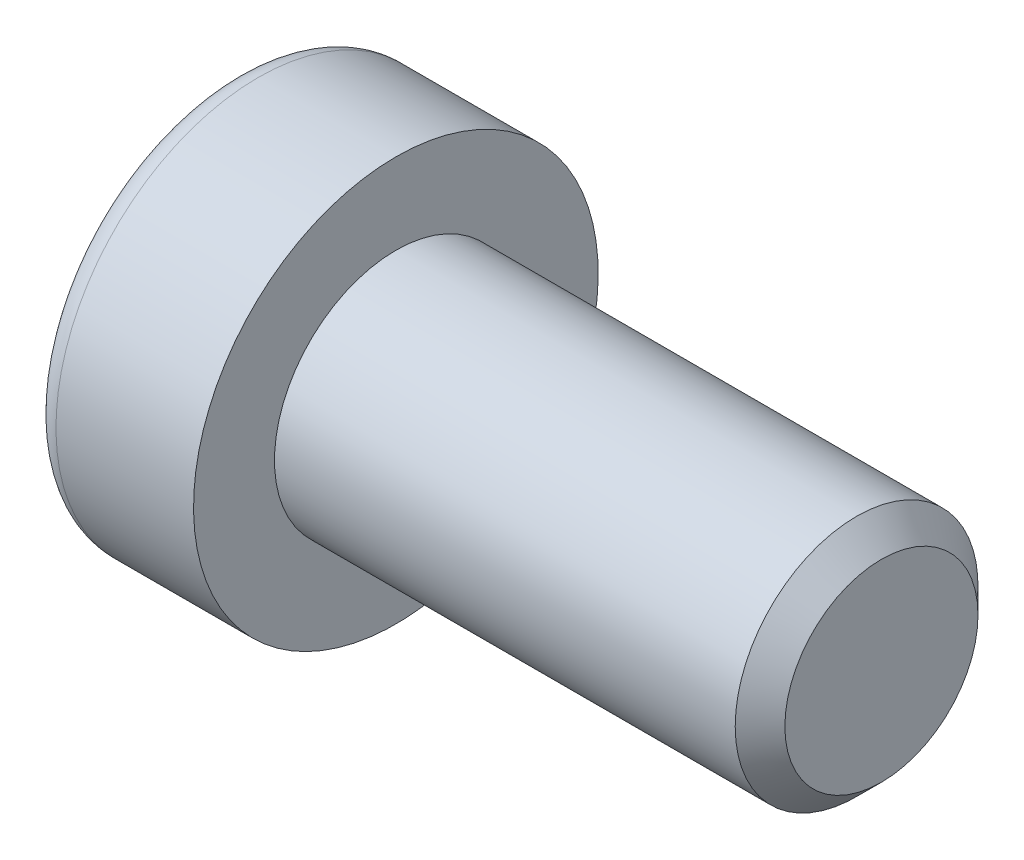
ISO-10303-21;
HEADER;
FILE_DESCRIPTION(('STEP AP214'),'2;1');
FILE_NAME('part.step','',(''),(''),'','','');
FILE_SCHEMA(('AUTOMOTIVE_DESIGN { 1 0 10303 214 1 1 1 1 }'));
ENDSEC;
DATA;
#1=APPLICATION_CONTEXT('core data for automotive mechanical design processes');
#2=APPLICATION_PROTOCOL_DEFINITION('international standard','automotive_design',2000,#1);
#3=PRODUCT_CONTEXT('',#1,'mechanical');
#4=PRODUCT('Part','Part','',(#3));
#5=PRODUCT_RELATED_PRODUCT_CATEGORY('part','',(#4));
#6=PRODUCT_DEFINITION_FORMATION('','',#4);
#7=PRODUCT_DEFINITION_CONTEXT('part definition',#1,'design');
#8=PRODUCT_DEFINITION('design','',#6,#7);
#9=PRODUCT_DEFINITION_SHAPE('','',#8);
#10=(LENGTH_UNIT() NAMED_UNIT(*) SI_UNIT(.MILLI.,.METRE.));
#11=(NAMED_UNIT(*) PLANE_ANGLE_UNIT() SI_UNIT($,.RADIAN.));
#12=(NAMED_UNIT(*) SI_UNIT($,.STERADIAN.) SOLID_ANGLE_UNIT());
#13=UNCERTAINTY_MEASURE_WITH_UNIT(LENGTH_MEASURE(1.E-05),#10,'distance_accuracy_value','');
#14=(GEOMETRIC_REPRESENTATION_CONTEXT(3) GLOBAL_UNCERTAINTY_ASSIGNED_CONTEXT((#13)) GLOBAL_UNIT_ASSIGNED_CONTEXT((#10,
#11,#12)) REPRESENTATION_CONTEXT('',''));
#15=CARTESIAN_POINT('',(0.,0.,0.));
#16=DIRECTION('',(0.,0.,1.));
#17=DIRECTION('',(1.,0.,0.));
#18=AXIS2_PLACEMENT_3D('',#15,#16,#17);
#19=CARTESIAN_POINT('',(-1.00800000126355,0.,0.));
#20=DIRECTION('',(-1.,0.,0.));
#21=DIRECTION('',(0.,0.,1.));
#22=AXIS2_PLACEMENT_3D('',#19,#20,#21);
#23=CONICAL_SURFACE('',#22,2.32325748220319,1.04719754984266);
#24=CARTESIAN_POINT('',(0.333333335333919,-2.27373675443232E-10,0.));
#25=VERTEX_POINT('',#24);
#26=VERTEX_LOOP('',#25);
#27=FACE_BOUND('',#26,.T.);
#28=CARTESIAN_POINT('',(-1.00000000148083,2.00000000033728,1.15470053795177));
#29=CARTESIAN_POINT('',(-0.970695546656412,2.00000000012114,1.05321634683082));
#30=CARTESIAN_POINT('',(-0.944044678609069,2.00000000003247,0.950856145630906));
#31=CARTESIAN_POINT('',(-0.897526388820767,1.99999999996746,0.744363444823034));
#32=CARTESIAN_POINT('',(-0.877675421691299,1.99999999999139,0.640227277433704));
#33=CARTESIAN_POINT('',(-0.84677596021723,2.0000000000084,0.43324544997504));
#34=CARTESIAN_POINT('',(-0.835521788851128,2.00000000000224,0.330431627792259));
#35=CARTESIAN_POINT('',(-0.822089169378264,1.99999999999776,0.124320462818437));
#36=CARTESIAN_POINT('',(-0.819899595232345,1.99999999999944,0.0210238686714094));
#37=CARTESIAN_POINT('',(-0.824466291460138,2.00000000000049,-0.171974736001679));
#38=CARTESIAN_POINT('',(-0.830101286547052,2.00000000000013,-0.261705707541263));
#39=CARTESIAN_POINT('',(-0.847957302106096,1.99999999999987,-0.440583082607356));
#40=CARTESIAN_POINT('',(-0.86018441618838,1.99999999999996,-0.529728867906561));
#41=CARTESIAN_POINT('',(-0.890749834828529,2.00000000000004,-0.708974747233866));
#42=CARTESIAN_POINT('',(-0.909217643747823,2.00000000000002,-0.799052166721046));
#43=CARTESIAN_POINT('',(-0.95113176245156,1.99999999999998,-0.977863889550314));
#44=CARTESIAN_POINT('',(-0.974568230407688,1.99999999999996,-1.06660048191016));
#45=CARTESIAN_POINT('',(-1.00000000170015,2.,-1.15470053794658));
#46=B_SPLINE_CURVE_WITH_KNOTS('',3,(#28,#29,#30,#31,#32,#33,#34,#35,#36,#37,#38,#39,#40,#41,#42,
#43,#44,#45),.UNSPECIFIED.,.F.,.F.,(4,2,2,2,2,2,2,2,4),(0.,0.317016011629405,0.634793817184081,
0.944707606355673,1.25424088914081,1.52370778262096,1.79342419353215,2.06912162199251,
2.34427797278029),.UNSPECIFIED.);
#47=CARTESIAN_POINT('',(-1.00000000168466,1.99999999978942,1.15470053825767));
#48=VERTEX_POINT('',#47);
#49=CARTESIAN_POINT('',(-1.00000000175486,2.,-1.15470053813609));
#50=VERTEX_POINT('',#49);
#51=EDGE_CURVE('E18',#48,#50,#46,.T.);
#52=ORIENTED_EDGE('',*,*,#51,.T.);
#53=CARTESIAN_POINT('',(-1.00000000148083,1.99999999979843,-1.15470053888509));
#54=CARTESIAN_POINT('',(-0.970695546656412,1.91211211209711,-1.20544263425837));
#55=CARTESIAN_POINT('',(-0.94404467860907,1.82346557747715,-1.25662273478154));
#56=CARTESIAN_POINT('',(-0.897526388820768,1.64463765284897,-1.35986908512918));
#57=CARTESIAN_POINT('',(-0.877675421691298,1.55445308644903,-1.41193716884456));
#58=CARTESIAN_POINT('',(-0.84677596021723,1.37520156575661,-1.51542808258863));
#59=CARTESIAN_POINT('',(-0.835521788851128,1.28616218388306,-1.56683499367469));
#60=CARTESIAN_POINT('',(-0.822089169378264,1.10766467900989,-1.66989057615772));
#61=CARTESIAN_POINT('',(-0.819899595232345,1.01820720435499,-1.72153887323269));
#62=CARTESIAN_POINT('',(-0.824466291460138,0.851065509813669,-1.81803817557014));
#63=CARTESIAN_POINT('',(-0.830101286547052,0.773356208953953,-1.86290366133962));
#64=CARTESIAN_POINT('',(-0.847957302106096,0.618443857984307,-1.95234234887244));
#65=CARTESIAN_POINT('',(-0.860184416188379,0.541241343274929,-1.99691524152212));
#66=CARTESIAN_POINT('',(-0.890749834828528,0.386009858253841,-2.08653818118584));
#67=CARTESIAN_POINT('',(-0.909217643747822,0.308000524670587,-2.13157689092942));
#68=CARTESIAN_POINT('',(-0.95113176245156,0.153145030205959,-2.22098275234402));
#69=CARTESIAN_POINT('',(-0.974568230407687,0.076296886977059,-2.26535104852392));
#70=CARTESIAN_POINT('',(-1.00000000170015,3.74709208758417E-10,-2.30940107654216));
#71=B_SPLINE_CURVE_WITH_KNOTS('',3,(#53,#54,#55,#56,#57,#58,#59,#60,#61,#62,#63,#64,#65,#66,#67,
#68,#69,#70),.UNSPECIFIED.,.F.,.F.,(4,2,2,2,2,2,2,2,4),(0.,0.317016011629406,0.634793817184081,
0.944707606355673,1.25424088914081,1.52370778262096,1.79342419353215,2.06912162199251,
2.34427797278028),.UNSPECIFIED.);
#72=CARTESIAN_POINT('',(-1.00000000168466,0.,-2.30940107651534));
#73=VERTEX_POINT('',#72);
#74=EDGE_CURVE('E78',#50,#73,#71,.T.);
#75=ORIENTED_EDGE('',*,*,#74,.T.);
#76=CARTESIAN_POINT('',(-1.00000000148083,-5.3885051347837E-10,-2.30940107683686));
#77=CARTESIAN_POINT('',(-0.970695546656412,-0.0878878880240306,-2.2586589810892));
#78=CARTESIAN_POINT('',(-0.944044678609069,-0.176534422555312,-2.20747888041245));
#79=CARTESIAN_POINT('',(-0.897526388820767,-0.355362347118482,-2.10423252995221));
#80=CARTESIAN_POINT('',(-0.877675421691299,-0.445546913542355,-2.05216444627827));
#81=CARTESIAN_POINT('',(-0.84677596021723,-0.624798434251795,-1.94867353256368));
#82=CARTESIAN_POINT('',(-0.835521788851128,-0.713837816119177,-1.89726662146695));
#83=CARTESIAN_POINT('',(-0.822089169378264,-0.892335320987875,-1.79421103897616));
#84=CARTESIAN_POINT('',(-0.819899595232345,-0.981792795644449,-1.7425627419041));
#85=CARTESIAN_POINT('',(-0.824466291460138,-1.14893449018682,-1.64606343956846));
#86=CARTESIAN_POINT('',(-0.830101286547052,-1.22664379104618,-1.60119795379836));
#87=CARTESIAN_POINT('',(-0.847957302106096,-1.38155614201556,-1.51175926626509));
#88=CARTESIAN_POINT('',(-0.860184416188379,-1.45875865672503,-1.46718637361557));
#89=CARTESIAN_POINT('',(-0.890749834828529,-1.6139901417462,-1.37756343395198));
#90=CARTESIAN_POINT('',(-0.909217643747823,-1.69199947532943,-1.33252472420837));
#91=CARTESIAN_POINT('',(-0.95113176245156,-1.84685496979402,-1.2431188627937));
#92=CARTESIAN_POINT('',(-0.974568230407687,-1.9237031130229,-1.19875056661377));
#93=CARTESIAN_POINT('',(-1.00000000170015,-1.99999999962529,-1.15470053859559));
#94=B_SPLINE_CURVE_WITH_KNOTS('',3,(#76,#77,#78,#79,#80,#81,#82,#83,#84,#85,#86,#87,#88,#89,#90,
#91,#92,#93),.UNSPECIFIED.,.F.,.F.,(4,2,2,2,2,2,2,2,4),(0.,0.317016011629405,0.63479381718408,
0.944707606355672,1.25424088914081,1.52370778262096,1.79342419353215,2.06912162199251,
2.34427797278029),.UNSPECIFIED.);
#95=CARTESIAN_POINT('',(-1.00000000168466,-1.99999999978942,-1.15470053825767));
#96=VERTEX_POINT('',#95);
#97=EDGE_CURVE('E103',#73,#96,#94,.T.);
#98=ORIENTED_EDGE('',*,*,#97,.T.);
#99=CARTESIAN_POINT('',(-1.00000000148083,-2.00000000033728,-1.15470053795177));
#100=CARTESIAN_POINT('',(-0.970695546656412,-2.00000000012114,-1.05321634683083));
#101=CARTESIAN_POINT('',(-0.944044678609069,-2.00000000003247,-0.950856145630907));
#102=CARTESIAN_POINT('',(-0.897526388820767,-1.99999999996746,-0.744363444823036));
#103=CARTESIAN_POINT('',(-0.877675421691298,-1.99999999999138,-0.640227277433706));
#104=CARTESIAN_POINT('',(-0.84677596021723,-2.0000000000084,-0.433245449975042));
#105=CARTESIAN_POINT('',(-0.835521788851128,-2.00000000000224,-0.330431627792262));
#106=CARTESIAN_POINT('',(-0.822089169378263,-1.99999999999776,-0.124320462818439));
#107=CARTESIAN_POINT('',(-0.819899595232344,-1.99999999999944,-0.0210238686714119));
#108=CARTESIAN_POINT('',(-0.824466291460138,-2.00000000000049,0.171974736001677));
#109=CARTESIAN_POINT('',(-0.830101286547052,-2.00000000000013,0.26170570754126));
#110=CARTESIAN_POINT('',(-0.847957302106096,-1.99999999999987,0.440583082607354));
#111=CARTESIAN_POINT('',(-0.860184416188379,-1.99999999999996,0.529728867906559));
#112=CARTESIAN_POINT('',(-0.890749834828528,-2.00000000000004,0.708974747233865));
#113=CARTESIAN_POINT('',(-0.909217643747822,-2.00000000000002,0.799052166721045));
#114=CARTESIAN_POINT('',(-0.951131762451559,-1.99999999999998,0.977863889550313));
#115=CARTESIAN_POINT('',(-0.974568230407687,-1.99999999999996,1.06660048191016));
#116=CARTESIAN_POINT('',(-1.00000000170015,-2.,1.15470053794658));
#117=B_SPLINE_CURVE_WITH_KNOTS('',3,(#99,#100,#101,#102,#103,#104,#105,#106,#107,#108,#109,#110,
#111,#112,#113,#114,#115,#116),.UNSPECIFIED.,.F.,.F.,(4,2,2,2,2,2,2,2,4),(0.,0.317016011629405,
0.63479381718408,0.944707606355672,1.25424088914081,1.52370778262096,1.79342419353215,
2.06912162199251,2.34427797278029),.UNSPECIFIED.);
#118=CARTESIAN_POINT('',(-1.00000000168466,-1.99999999978942,1.15470053825767));
#119=VERTEX_POINT('',#118);
#120=EDGE_CURVE('E127',#96,#119,#117,.T.);
#121=ORIENTED_EDGE('',*,*,#120,.T.);
#122=CARTESIAN_POINT('',(-1.00000000148083,-1.99999999979843,1.15470053888509));
#123=CARTESIAN_POINT('',(-0.970695546656412,-1.91211211209711,1.20544263425837));
#124=CARTESIAN_POINT('',(-0.94404467860907,-1.82346557747716,1.25662273478154));
#125=CARTESIAN_POINT('',(-0.897526388820768,-1.64463765284897,1.35986908512917));
#126=CARTESIAN_POINT('',(-0.877675421691299,-1.55445308644903,1.41193716884456));
#127=CARTESIAN_POINT('',(-0.84677596021723,-1.37520156575661,1.51542808258863));
#128=CARTESIAN_POINT('',(-0.835521788851128,-1.28616218388306,1.56683499367469));
#129=CARTESIAN_POINT('',(-0.822089169378263,-1.10766467900989,1.66989057615772));
#130=CARTESIAN_POINT('',(-0.819899595232344,-1.01820720435499,1.72153887323269));
#131=CARTESIAN_POINT('',(-0.824466291460138,-0.85106550981367,1.81803817557014));
#132=CARTESIAN_POINT('',(-0.830101286547052,-0.773356208953954,1.86290366133962));
#133=CARTESIAN_POINT('',(-0.847957302106096,-0.618443857984308,1.95234234887244));
#134=CARTESIAN_POINT('',(-0.860184416188379,-0.54124134327493,1.99691524152212));
#135=CARTESIAN_POINT('',(-0.890749834828528,-0.386009858253842,2.08653818118584));
#136=CARTESIAN_POINT('',(-0.909217643747822,-0.308000524670587,2.13157689092942));
#137=CARTESIAN_POINT('',(-0.951131762451559,-0.153145030205959,2.22098275234402));
#138=CARTESIAN_POINT('',(-0.974568230407687,-0.076296886977059,2.26535104852392));
#139=CARTESIAN_POINT('',(-1.00000000170015,-3.74708969238079E-10,2.30940107654216));
#140=B_SPLINE_CURVE_WITH_KNOTS('',3,(#122,#123,#124,#125,#126,#127,#128,#129,#130,#131,#132,
#133,#134,#135,#136,#137,#138,#139),.UNSPECIFIED.,.F.,.F.,(4,2,2,2,2,2,2,2,4),(0.,
0.317016011629405,0.63479381718408,0.944707606355673,1.25424088914081,1.52370778262096,
1.79342419353215,2.06912162199251,2.34427797278029),.UNSPECIFIED.);
#141=CARTESIAN_POINT('',(-1.00000000168466,0.,2.30940107651534));
#142=VERTEX_POINT('',#141);
#143=EDGE_CURVE('E135',#119,#142,#140,.T.);
#144=ORIENTED_EDGE('',*,*,#143,.T.);
#145=CARTESIAN_POINT('',(-1.00000000148083,5.38850492788213E-10,2.30940107683686));
#146=CARTESIAN_POINT('',(-0.970695546656412,0.0878878880240308,2.2586589810892));
#147=CARTESIAN_POINT('',(-0.944044678609069,0.176534422555312,2.20747888041245));
#148=CARTESIAN_POINT('',(-0.897526388820767,0.355362347118482,2.10423252995221));
#149=CARTESIAN_POINT('',(-0.877675421691298,0.445546913542355,2.05216444627827));
#150=CARTESIAN_POINT('',(-0.846775960217229,0.624798434251794,1.94867353256367));
#151=CARTESIAN_POINT('',(-0.835521788851128,0.713837816119177,1.89726662146695));
#152=CARTESIAN_POINT('',(-0.822089169378263,0.892335320987874,1.79421103897616));
#153=CARTESIAN_POINT('',(-0.819899595232344,0.981792795644449,1.7425627419041));
#154=CARTESIAN_POINT('',(-0.824466291460137,1.14893449018682,1.64606343956846));
#155=CARTESIAN_POINT('',(-0.830101286547051,1.22664379104618,1.60119795379836));
#156=CARTESIAN_POINT('',(-0.847957302106095,1.38155614201556,1.51175926626508));
#157=CARTESIAN_POINT('',(-0.860184416188378,1.45875865672503,1.46718637361556));
#158=CARTESIAN_POINT('',(-0.890749834828528,1.6139901417462,1.37756343395198));
#159=CARTESIAN_POINT('',(-0.909217643747822,1.69199947532943,1.33252472420837));
#160=CARTESIAN_POINT('',(-0.951131762451559,1.84685496979402,1.2431188627937));
#161=CARTESIAN_POINT('',(-0.974568230407686,1.9237031130229,1.19875056661376));
#162=CARTESIAN_POINT('',(-1.00000000170015,1.99999999962529,1.15470053859559));
#163=B_SPLINE_CURVE_WITH_KNOTS('',3,(#145,#146,#147,#148,#149,#150,#151,#152,#153,#154,#155,
#156,#157,#158,#159,#160,#161,#162),.UNSPECIFIED.,.F.,.F.,(4,2,2,2,2,2,2,2,4),(0.,
0.317016011629406,0.63479381718408,0.944707606355673,1.25424088914081,1.52370778262096,
1.79342419353215,2.06912162199251,2.34427797278029),.UNSPECIFIED.);
#164=EDGE_CURVE('E80',#142,#48,#163,.T.);
#165=ORIENTED_EDGE('',*,*,#164,.T.);
#166=EDGE_LOOP('',(#52,#75,#98,#121,#144,#165));
#167=FACE_BOUND('',#166,.T.);
#168=ADVANCED_FACE('F14',(#27,#167),#23,.F.);
#169=CARTESIAN_POINT('',(-3.99999999999999,2.,1.15470053837925));
#170=DIRECTION('',(0.,1.,0.));
#171=DIRECTION('',(0.,0.,1.));
#172=AXIS2_PLACEMENT_3D('',#169,#170,#171);
#173=PLANE('',#172);
#174=DIRECTION('',(1.,0.,0.));
#175=VECTOR('',#174,1.);
#176=CARTESIAN_POINT('',(-3.99999999999999,2.,1.15470053837925));
#177=LINE('',#176,#175);
#178=CARTESIAN_POINT('',(-3.99999999999999,2.,1.15470053837925));
#179=VERTEX_POINT('',#178);
#180=EDGE_CURVE('E82',#48,#179,#177,.F.);
#181=ORIENTED_EDGE('',*,*,#180,.T.);
#182=DIRECTION('',(0.,0.,1.));
#183=VECTOR('',#182,1.);
#184=CARTESIAN_POINT('',(-3.99999999999999,2.,0.));
#185=LINE('',#184,#183);
#186=CARTESIAN_POINT('',(-3.99999999999999,2.,-1.15470053837925));
#187=VERTEX_POINT('',#186);
#188=EDGE_CURVE('E87',#187,#179,#185,.T.);
#189=ORIENTED_EDGE('',*,*,#188,.F.);
#190=DIRECTION('',(1.,0.,0.));
#191=VECTOR('',#190,1.);
#192=CARTESIAN_POINT('',(-3.99999999999999,2.,-1.15470053837925));
#193=LINE('',#192,#191);
#194=EDGE_CURVE('E85',#187,#50,#193,.T.);
#195=ORIENTED_EDGE('',*,*,#194,.T.);
#196=ORIENTED_EDGE('',*,*,#51,.F.);
#197=EDGE_LOOP('',(#181,#189,#195,#196));
#198=FACE_BOUND('',#197,.T.);
#199=ADVANCED_FACE('F74',(#198),#173,.F.);
#200=CARTESIAN_POINT('',(-3.99999999999999,0.,2.3094010767585));
#201=DIRECTION('',(0.,0.500000000000001,0.866025403784438));
#202=DIRECTION('',(0.,-0.866025403784438,0.500000000000001));
#203=AXIS2_PLACEMENT_3D('',#200,#201,#202);
#204=PLANE('',#203);
#205=DIRECTION('',(1.,0.,0.));
#206=VECTOR('',#205,1.);
#207=CARTESIAN_POINT('',(-3.99999999999999,0.,2.3094010767585));
#208=LINE('',#207,#206);
#209=CARTESIAN_POINT('',(-3.99999999999999,0.,2.3094010767585));
#210=VERTEX_POINT('',#209);
#211=EDGE_CURVE('E139',#142,#210,#208,.F.);
#212=ORIENTED_EDGE('',*,*,#211,.T.);
#213=DIRECTION('',(0.,-0.866025403784438,0.500000000000001));
#214=VECTOR('',#213,1.);
#215=CARTESIAN_POINT('',(-3.99999999999999,2.,1.15470053837925));
#216=LINE('',#215,#214);
#217=EDGE_CURVE('E93',#179,#210,#216,.T.);
#218=ORIENTED_EDGE('',*,*,#217,.F.);
#219=ORIENTED_EDGE('',*,*,#180,.F.);
#220=ORIENTED_EDGE('',*,*,#164,.F.);
#221=EDGE_LOOP('',(#212,#218,#219,#220));
#222=FACE_BOUND('',#221,.T.);
#223=ADVANCED_FACE('F143',(#222),#204,.F.);
#224=CARTESIAN_POINT('',(-3.99999999999999,-2.,1.15470053837925));
#225=DIRECTION('',(0.,-0.5,0.866025403784439));
#226=DIRECTION('',(0.,-0.866025403784439,-0.5));
#227=AXIS2_PLACEMENT_3D('',#224,#225,#226);
#228=PLANE('',#227);
#229=DIRECTION('',(1.,0.,0.));
#230=VECTOR('',#229,1.);
#231=CARTESIAN_POINT('',(-3.99999999999999,-2.,1.15470053837925));
#232=LINE('',#231,#230);
#233=CARTESIAN_POINT('',(-3.99999999999999,-2.,1.15470053837925));
#234=VERTEX_POINT('',#233);
#235=EDGE_CURVE('E134',#119,#234,#232,.F.);
#236=ORIENTED_EDGE('',*,*,#235,.T.);
#237=DIRECTION('',(0.,-0.866025403784439,-0.5));
#238=VECTOR('',#237,1.);
#239=CARTESIAN_POINT('',(-3.99999999999999,0.,2.3094010767585));
#240=LINE('',#239,#238);
#241=EDGE_CURVE('E240',#210,#234,#240,.T.);
#242=ORIENTED_EDGE('',*,*,#241,.F.);
#243=ORIENTED_EDGE('',*,*,#211,.F.);
#244=ORIENTED_EDGE('',*,*,#143,.F.);
#245=EDGE_LOOP('',(#236,#242,#243,#244));
#246=FACE_BOUND('',#245,.T.);
#247=ADVANCED_FACE('F123',(#246),#228,.F.);
#248=CARTESIAN_POINT('',(-3.99999999999999,-2.,-1.15470053837925));
#249=DIRECTION('',(0.,-1.,0.));
#250=DIRECTION('',(0.,0.,-1.));
#251=AXIS2_PLACEMENT_3D('',#248,#249,#250);
#252=PLANE('',#251);
#253=DIRECTION('',(1.,0.,0.));
#254=VECTOR('',#253,1.);
#255=CARTESIAN_POINT('',(-3.99999999999999,-2.,-1.15470053837925));
#256=LINE('',#255,#254);
#257=CARTESIAN_POINT('',(-3.99999999999999,-2.,-1.15470053837925));
#258=VERTEX_POINT('',#257);
#259=EDGE_CURVE('E133',#96,#258,#256,.F.);
#260=ORIENTED_EDGE('',*,*,#259,.T.);
#261=DIRECTION('',(0.,0.,1.));
#262=VECTOR('',#261,1.);
#263=CARTESIAN_POINT('',(-3.99999999999999,-2.,0.));
#264=LINE('',#263,#262);
#265=EDGE_CURVE('E235',#234,#258,#264,.F.);
#266=ORIENTED_EDGE('',*,*,#265,.F.);
#267=ORIENTED_EDGE('',*,*,#235,.F.);
#268=ORIENTED_EDGE('',*,*,#120,.F.);
#269=EDGE_LOOP('',(#260,#266,#267,#268));
#270=FACE_BOUND('',#269,.T.);
#271=ADVANCED_FACE('F119',(#270),#252,.F.);
#272=CARTESIAN_POINT('',(-3.99999999999999,0.,-2.3094010767585));
#273=DIRECTION('',(0.,-0.5,-0.866025403784439));
#274=DIRECTION('',(0.,0.866025403784439,-0.5));
#275=AXIS2_PLACEMENT_3D('',#272,#273,#274);
#276=PLANE('',#275);
#277=DIRECTION('',(1.,0.,0.));
#278=VECTOR('',#277,1.);
#279=CARTESIAN_POINT('',(-3.99999999999999,0.,-2.3094010767585));
#280=LINE('',#279,#278);
#281=CARTESIAN_POINT('',(-3.99999999999999,0.,-2.3094010767585));
#282=VERTEX_POINT('',#281);
#283=EDGE_CURVE('E36',#73,#282,#280,.F.);
#284=ORIENTED_EDGE('',*,*,#283,.T.);
#285=DIRECTION('',(0.,0.866025403784438,-0.5));
#286=VECTOR('',#285,1.);
#287=CARTESIAN_POINT('',(-3.99999999999999,-2.,-1.15470053837925));
#288=LINE('',#287,#286);
#289=EDGE_CURVE('E230',#258,#282,#288,.T.);
#290=ORIENTED_EDGE('',*,*,#289,.F.);
#291=ORIENTED_EDGE('',*,*,#259,.F.);
#292=ORIENTED_EDGE('',*,*,#97,.F.);
#293=EDGE_LOOP('',(#284,#290,#291,#292));
#294=FACE_BOUND('',#293,.T.);
#295=ADVANCED_FACE('F113',(#294),#276,.F.);
#296=CARTESIAN_POINT('',(-3.99999999999999,2.,-1.15470053837925));
#297=DIRECTION('',(0.,0.5,-0.866025403784439));
#298=DIRECTION('',(0.,0.866025403784439,0.5));
#299=AXIS2_PLACEMENT_3D('',#296,#297,#298);
#300=PLANE('',#299);
#301=ORIENTED_EDGE('',*,*,#194,.F.);
#302=DIRECTION('',(0.,0.866025403784439,0.5));
#303=VECTOR('',#302,1.);
#304=CARTESIAN_POINT('',(-3.99999999999999,0.,-2.3094010767585));
#305=LINE('',#304,#303);
#306=EDGE_CURVE('E228',#282,#187,#305,.T.);
#307=ORIENTED_EDGE('',*,*,#306,.F.);
#308=ORIENTED_EDGE('',*,*,#283,.F.);
#309=ORIENTED_EDGE('',*,*,#74,.F.);
#310=EDGE_LOOP('',(#301,#307,#308,#309));
#311=FACE_BOUND('',#310,.T.);
#312=ADVANCED_FACE('F91',(#311),#300,.F.);
#313=CARTESIAN_POINT('',(-3.99999999999999,3.65470053837925,0.));
#314=DIRECTION('',(-1.,0.,0.));
#315=DIRECTION('',(0.,0.,1.));
#316=AXIS2_PLACEMENT_3D('',#313,#314,#315);
#317=PLANE('',#316);
#318=ORIENTED_EDGE('',*,*,#289,.T.);
#319=ORIENTED_EDGE('',*,*,#306,.T.);
#320=ORIENTED_EDGE('',*,*,#188,.T.);
#321=ORIENTED_EDGE('',*,*,#217,.T.);
#322=ORIENTED_EDGE('',*,*,#241,.T.);
#323=ORIENTED_EDGE('',*,*,#265,.T.);
#324=EDGE_LOOP('',(#318,#319,#320,#321,#322,#323));
#325=FACE_BOUND('',#324,.T.);
#326=CARTESIAN_POINT('',(-3.99999999999999,0.,0.));
#327=DIRECTION('',(1.,0.,0.));
#328=DIRECTION('',(0.,1.,0.));
#329=AXIS2_PLACEMENT_3D('',#326,#327,#328);
#330=CIRCLE('',#329,4.4);
#331=CARTESIAN_POINT('',(-3.99999999999999,4.4,0.));
#332=VERTEX_POINT('',#331);
#333=EDGE_CURVE('E191',#332,#332,#330,.T.);
#334=ORIENTED_EDGE('',*,*,#333,.F.);
#335=EDGE_LOOP('',(#334));
#336=FACE_BOUND('',#335,.T.);
#337=ADVANCED_FACE('F112',(#325,#336),#317,.T.);
#338=CARTESIAN_POINT('',(-3.4,0.,0.));
#339=DIRECTION('',(1.,0.,0.));
#340=DIRECTION('',(0.,0.,-1.));
#341=AXIS2_PLACEMENT_3D('',#338,#339,#340);
#342=TOROIDAL_SURFACE('',#341,4.4,0.6);
#343=CARTESIAN_POINT('',(-3.4,0.,0.));
#344=DIRECTION('',(1.,0.,0.));
#345=DIRECTION('',(0.,1.,0.));
#346=AXIS2_PLACEMENT_3D('',#343,#344,#345);
#347=CIRCLE('',#346,5.);
#348=CARTESIAN_POINT('',(-3.4,5.,0.));
#349=VERTEX_POINT('',#348);
#350=EDGE_CURVE('E256',#349,#349,#347,.T.);
#351=ORIENTED_EDGE('',*,*,#350,.F.);
#352=EDGE_LOOP('',(#351));
#353=FACE_BOUND('',#352,.T.);
#354=ORIENTED_EDGE('',*,*,#333,.T.);
#355=EDGE_LOOP('',(#354));
#356=FACE_BOUND('',#355,.T.);
#357=ADVANCED_FACE('F175',(#353,#356),#342,.T.);
#358=CARTESIAN_POINT('',(-2.,0.,0.));
#359=DIRECTION('',(1.,0.,0.));
#360=DIRECTION('',(0.,1.,0.));
#361=AXIS2_PLACEMENT_3D('',#358,#359,#360);
#362=CYLINDRICAL_SURFACE('',#361,5.);
#363=ORIENTED_EDGE('',*,*,#350,.T.);
#364=EDGE_LOOP('',(#363));
#365=FACE_BOUND('',#364,.T.);
#366=CARTESIAN_POINT('',(0.,0.,0.));
#367=DIRECTION('',(1.,0.,0.));
#368=DIRECTION('',(0.,1.,0.));
#369=AXIS2_PLACEMENT_3D('',#366,#367,#368);
#370=CIRCLE('',#369,5.);
#371=CARTESIAN_POINT('',(0.,5.,0.));
#372=VERTEX_POINT('',#371);
#373=EDGE_CURVE('E101',#372,#372,#370,.T.);
#374=ORIENTED_EDGE('',*,*,#373,.F.);
#375=EDGE_LOOP('',(#374));
#376=FACE_BOUND('',#375,.T.);
#377=ADVANCED_FACE('F172',(#365,#376),#362,.T.);
#378=CARTESIAN_POINT('',(12.,1.5,0.));
#379=DIRECTION('',(1.,0.,0.));
#380=DIRECTION('',(0.,0.,-1.));
#381=AXIS2_PLACEMENT_3D('',#378,#379,#380);
#382=PLANE('',#381);
#383=CARTESIAN_POINT('',(12.0000000002847,0.,0.));
#384=DIRECTION('',(-1.,0.,0.));
#385=DIRECTION('',(0.,0.,1.));
#386=AXIS2_PLACEMENT_3D('',#383,#384,#385);
#387=CIRCLE('',#386,2.38655000026711);
#388=CARTESIAN_POINT('',(12.0000000002847,0.,2.38655000026711));
#389=VERTEX_POINT('',#388);
#390=EDGE_CURVE('E252',#389,#389,#387,.T.);
#391=ORIENTED_EDGE('',*,*,#390,.F.);
#392=EDGE_LOOP('',(#391));
#393=FACE_BOUND('',#392,.T.);
#394=ADVANCED_FACE('F168',(#393),#382,.T.);
#395=CARTESIAN_POINT('',(0.,4.,0.));
#396=DIRECTION('',(1.,0.,0.));
#397=DIRECTION('',(0.,0.,-1.));
#398=AXIS2_PLACEMENT_3D('',#395,#396,#397);
#399=PLANE('',#398);
#400=CARTESIAN_POINT('',(0.,0.,0.));
#401=DIRECTION('',(1.,0.,0.));
#402=DIRECTION('',(0.,1.,0.));
#403=AXIS2_PLACEMENT_3D('',#400,#401,#402);
#404=CIRCLE('',#403,3.);
#405=CARTESIAN_POINT('',(0.,3.,0.));
#406=VERTEX_POINT('',#405);
#407=EDGE_CURVE('E27',#406,#406,#404,.T.);
#408=ORIENTED_EDGE('',*,*,#407,.F.);
#409=EDGE_LOOP('',(#408));
#410=FACE_BOUND('',#409,.T.);
#411=ORIENTED_EDGE('',*,*,#373,.T.);
#412=EDGE_LOOP('',(#411));
#413=FACE_BOUND('',#412,.T.);
#414=ADVANCED_FACE('F161',(#410,#413),#399,.T.);
#415=CARTESIAN_POINT('',(11.3865499997132,0.,0.));
#416=DIRECTION('',(-1.,0.,0.));
#417=DIRECTION('',(0.,0.,1.));
#418=AXIS2_PLACEMENT_3D('',#415,#416,#417);
#419=CONICAL_SURFACE('',#418,2.99999999975853,0.785398162517161);
#420=ORIENTED_EDGE('',*,*,#390,.T.);
#421=EDGE_LOOP('',(#420));
#422=FACE_BOUND('',#421,.T.);
#423=CARTESIAN_POINT('',(11.38655,0.,0.));
#424=DIRECTION('',(1.,0.,0.));
#425=DIRECTION('',(0.,1.,0.));
#426=AXIS2_PLACEMENT_3D('',#423,#424,#425);
#427=CIRCLE('',#426,3.);
#428=CARTESIAN_POINT('',(11.38655,3.,0.));
#429=VERTEX_POINT('',#428);
#430=EDGE_CURVE('E9',#429,#429,#427,.F.);
#431=ORIENTED_EDGE('',*,*,#430,.F.);
#432=EDGE_LOOP('',(#431));
#433=FACE_BOUND('',#432,.T.);
#434=ADVANCED_FACE('F154',(#422,#433),#419,.T.);
#435=CARTESIAN_POINT('',(7.5,0.,0.));
#436=DIRECTION('',(1.,0.,0.));
#437=DIRECTION('',(0.,1.,0.));
#438=AXIS2_PLACEMENT_3D('',#435,#436,#437);
#439=CYLINDRICAL_SURFACE('',#438,3.);
#440=ORIENTED_EDGE('',*,*,#430,.T.);
#441=EDGE_LOOP('',(#440));
#442=FACE_BOUND('',#441,.T.);
#443=ORIENTED_EDGE('',*,*,#407,.T.);
#444=EDGE_LOOP('',(#443));
#445=FACE_BOUND('',#444,.T.);
#446=ADVANCED_FACE('F152',(#442,#445),#439,.T.);
#447=CLOSED_SHELL('',(#168,#199,#223,#247,#271,#295,#312,#337,#357,#377,#394,#414,#434,#446));
#448=MANIFOLD_SOLID_BREP('B1',#447);
#449=ADVANCED_BREP_SHAPE_REPRESENTATION('',(#18,#448),#14);
#450=SHAPE_DEFINITION_REPRESENTATION(#9,#449);
ENDSEC;
END-ISO-10303-21;
